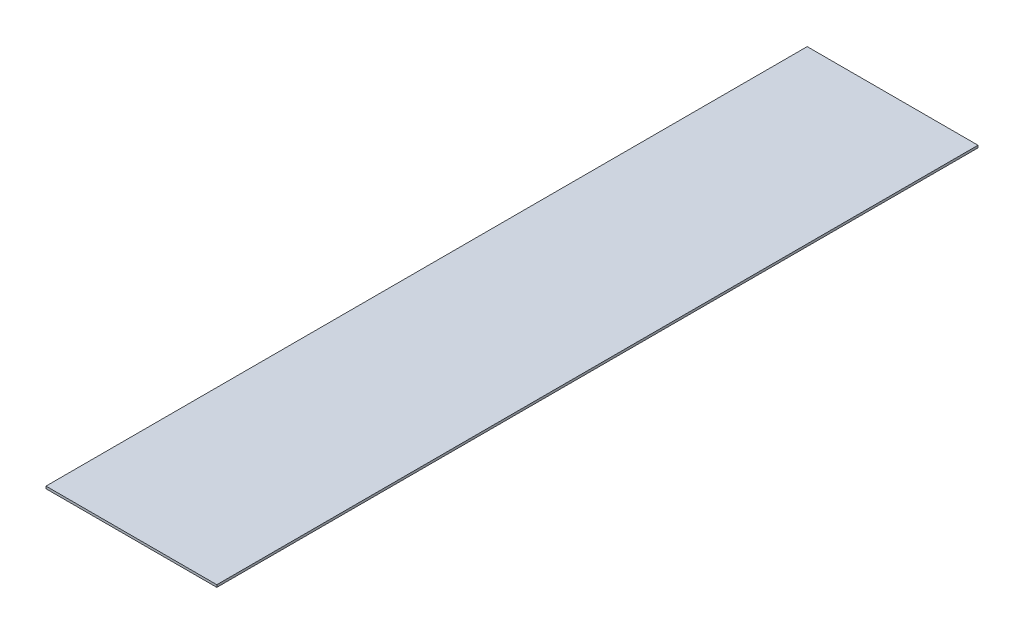
ISO-10303-21;
HEADER;
FILE_DESCRIPTION(('STEP AP214'),'2;1');
FILE_NAME('part.step','',(''),(''),'','','');
FILE_SCHEMA(('AUTOMOTIVE_DESIGN { 1 0 10303 214 1 1 1 1 }'));
ENDSEC;
DATA;
#1=APPLICATION_CONTEXT('core data for automotive mechanical design processes');
#2=APPLICATION_PROTOCOL_DEFINITION('international standard','automotive_design',2000,#1);
#3=PRODUCT_CONTEXT('',#1,'mechanical');
#4=PRODUCT('Part','Part','',(#3));
#5=PRODUCT_RELATED_PRODUCT_CATEGORY('part','',(#4));
#6=PRODUCT_DEFINITION_FORMATION('','',#4);
#7=PRODUCT_DEFINITION_CONTEXT('part definition',#1,'design');
#8=PRODUCT_DEFINITION('design','',#6,#7);
#9=PRODUCT_DEFINITION_SHAPE('','',#8);
#10=(LENGTH_UNIT() NAMED_UNIT(*) SI_UNIT(.MILLI.,.METRE.));
#11=(NAMED_UNIT(*) PLANE_ANGLE_UNIT() SI_UNIT($,.RADIAN.));
#12=(NAMED_UNIT(*) SI_UNIT($,.STERADIAN.) SOLID_ANGLE_UNIT());
#13=UNCERTAINTY_MEASURE_WITH_UNIT(LENGTH_MEASURE(1.E-05),#10,'distance_accuracy_value','');
#14=(GEOMETRIC_REPRESENTATION_CONTEXT(3) GLOBAL_UNCERTAINTY_ASSIGNED_CONTEXT((#13)) GLOBAL_UNIT_ASSIGNED_CONTEXT((#10,
#11,#12)) REPRESENTATION_CONTEXT('',''));
#15=CARTESIAN_POINT('',(0.,0.,0.));
#16=DIRECTION('',(0.,0.,1.));
#17=DIRECTION('',(1.,0.,0.));
#18=AXIS2_PLACEMENT_3D('',#15,#16,#17);
#19=CARTESIAN_POINT('',(-365.857303482587,2.54,-330.915875621891));
#20=DIRECTION('',(1.,0.,0.));
#21=DIRECTION('',(0.,0.,-1.));
#22=AXIS2_PLACEMENT_3D('',#19,#20,#21);
#23=PLANE('',#22);
#24=DIRECTION('',(0.,0.,1.));
#25=VECTOR('',#24,1.);
#26=CARTESIAN_POINT('',(-365.857303482587,0.,-330.915875621891));
#27=LINE('',#26,#25);
#28=CARTESIAN_POINT('',(-365.857303482587,0.,-330.915875621891));
#29=VERTEX_POINT('',#28);
#30=CARTESIAN_POINT('',(-365.857303482587,0.,495.346124378109));
#31=VERTEX_POINT('',#30);
#32=EDGE_CURVE('E107',#29,#31,#27,.T.);
#33=ORIENTED_EDGE('',*,*,#32,.T.);
#34=DIRECTION('',(0.,-1.,0.));
#35=VECTOR('',#34,1.);
#36=CARTESIAN_POINT('',(-365.857303482587,2.54,495.346124378109));
#37=LINE('',#36,#35);
#38=CARTESIAN_POINT('',(-365.857303482587,2.54,495.346124378109));
#39=VERTEX_POINT('',#38);
#40=EDGE_CURVE('E11',#39,#31,#37,.T.);
#41=ORIENTED_EDGE('',*,*,#40,.F.);
#42=DIRECTION('',(0.,0.,1.));
#43=VECTOR('',#42,1.);
#44=CARTESIAN_POINT('',(-365.857303482587,2.54,-330.915875621891));
#45=LINE('',#44,#43);
#46=CARTESIAN_POINT('',(-365.857303482587,2.54,-330.915875621891));
#47=VERTEX_POINT('',#46);
#48=EDGE_CURVE('E91',#47,#39,#45,.T.);
#49=ORIENTED_EDGE('',*,*,#48,.F.);
#50=DIRECTION('',(0.,-1.,0.));
#51=VECTOR('',#50,1.);
#52=CARTESIAN_POINT('',(-365.857303482587,2.54,-330.915875621891));
#53=LINE('',#52,#51);
#54=EDGE_CURVE('E103',#47,#29,#53,.T.);
#55=ORIENTED_EDGE('',*,*,#54,.T.);
#56=EDGE_LOOP('',(#33,#41,#49,#55));
#57=FACE_BOUND('',#56,.T.);
#58=ADVANCED_FACE('F39',(#57),#23,.F.);
#59=CARTESIAN_POINT('',(-365.857303482587,2.54,495.346124378109));
#60=DIRECTION('',(0.,0.,-1.));
#61=DIRECTION('',(-1.,0.,0.));
#62=AXIS2_PLACEMENT_3D('',#59,#60,#61);
#63=PLANE('',#62);
#64=DIRECTION('',(1.,0.,0.));
#65=VECTOR('',#64,1.);
#66=CARTESIAN_POINT('',(-365.857303482587,0.,495.346124378109));
#67=LINE('',#66,#65);
#68=CARTESIAN_POINT('',(-180.437303482587,0.,495.346124378109));
#69=VERTEX_POINT('',#68);
#70=EDGE_CURVE('E96',#31,#69,#67,.T.);
#71=ORIENTED_EDGE('',*,*,#70,.T.);
#72=DIRECTION('',(0.,-1.,0.));
#73=VECTOR('',#72,1.);
#74=CARTESIAN_POINT('',(-180.437303482587,2.54,495.346124378109));
#75=LINE('',#74,#73);
#76=CARTESIAN_POINT('',(-180.437303482587,2.54,495.346124378109));
#77=VERTEX_POINT('',#76);
#78=EDGE_CURVE('E48',#77,#69,#75,.T.);
#79=ORIENTED_EDGE('',*,*,#78,.F.);
#80=DIRECTION('',(1.,0.,0.));
#81=VECTOR('',#80,1.);
#82=CARTESIAN_POINT('',(-365.857303482587,2.54,495.346124378109));
#83=LINE('',#82,#81);
#84=EDGE_CURVE('E86',#39,#77,#83,.T.);
#85=ORIENTED_EDGE('',*,*,#84,.F.);
#86=ORIENTED_EDGE('',*,*,#40,.T.);
#87=EDGE_LOOP('',(#71,#79,#85,#86));
#88=FACE_BOUND('',#87,.T.);
#89=ADVANCED_FACE('F95',(#88),#63,.F.);
#90=CARTESIAN_POINT('',(-180.437303482587,2.54,-330.915875621891));
#91=DIRECTION('',(-1.,0.,0.));
#92=DIRECTION('',(0.,0.,1.));
#93=AXIS2_PLACEMENT_3D('',#90,#91,#92);
#94=PLANE('',#93);
#95=DIRECTION('',(0.,0.,-1.));
#96=VECTOR('',#95,1.);
#97=CARTESIAN_POINT('',(-180.437303482587,0.,-330.915875621891));
#98=LINE('',#97,#96);
#99=CARTESIAN_POINT('',(-180.437303482587,0.,-330.915875621891));
#100=VERTEX_POINT('',#99);
#101=EDGE_CURVE('E73',#69,#100,#98,.T.);
#102=ORIENTED_EDGE('',*,*,#101,.T.);
#103=DIRECTION('',(0.,-1.,0.));
#104=VECTOR('',#103,1.);
#105=CARTESIAN_POINT('',(-180.437303482587,2.54,-330.915875621891));
#106=LINE('',#105,#104);
#107=CARTESIAN_POINT('',(-180.437303482587,2.54,-330.915875621891));
#108=VERTEX_POINT('',#107);
#109=EDGE_CURVE('E98',#108,#100,#106,.T.);
#110=ORIENTED_EDGE('',*,*,#109,.F.);
#111=DIRECTION('',(0.,0.,-1.));
#112=VECTOR('',#111,1.);
#113=CARTESIAN_POINT('',(-180.437303482587,2.54,-330.915875621891));
#114=LINE('',#113,#112);
#115=EDGE_CURVE('E89',#77,#108,#114,.T.);
#116=ORIENTED_EDGE('',*,*,#115,.F.);
#117=ORIENTED_EDGE('',*,*,#78,.T.);
#118=EDGE_LOOP('',(#102,#110,#116,#117));
#119=FACE_BOUND('',#118,.T.);
#120=ADVANCED_FACE('F99',(#119),#94,.F.);
#121=CARTESIAN_POINT('',(-365.857303482587,2.54,-330.915875621891));
#122=DIRECTION('',(0.,0.,1.));
#123=DIRECTION('',(1.,0.,0.));
#124=AXIS2_PLACEMENT_3D('',#121,#122,#123);
#125=PLANE('',#124);
#126=DIRECTION('',(-1.,0.,0.));
#127=VECTOR('',#126,1.);
#128=CARTESIAN_POINT('',(-365.857303482587,0.,-330.915875621891));
#129=LINE('',#128,#127);
#130=EDGE_CURVE('E79',#100,#29,#129,.T.);
#131=ORIENTED_EDGE('',*,*,#130,.T.);
#132=ORIENTED_EDGE('',*,*,#54,.F.);
#133=DIRECTION('',(-1.,0.,0.));
#134=VECTOR('',#133,1.);
#135=CARTESIAN_POINT('',(-365.857303482587,2.54,-330.915875621891));
#136=LINE('',#135,#134);
#137=EDGE_CURVE('E56',#108,#47,#136,.T.);
#138=ORIENTED_EDGE('',*,*,#137,.F.);
#139=ORIENTED_EDGE('',*,*,#109,.T.);
#140=EDGE_LOOP('',(#131,#132,#138,#139));
#141=FACE_BOUND('',#140,.T.);
#142=ADVANCED_FACE('F120',(#141),#125,.F.);
#143=CARTESIAN_POINT('',(0.,2.54,0.));
#144=DIRECTION('',(0.,1.,0.));
#145=DIRECTION('',(0.,0.,1.));
#146=AXIS2_PLACEMENT_3D('',#143,#144,#145);
#147=PLANE('',#146);
#148=ORIENTED_EDGE('',*,*,#48,.T.);
#149=ORIENTED_EDGE('',*,*,#84,.T.);
#150=ORIENTED_EDGE('',*,*,#115,.T.);
#151=ORIENTED_EDGE('',*,*,#137,.T.);
#152=EDGE_LOOP('',(#148,#149,#150,#151));
#153=FACE_BOUND('',#152,.T.);
#154=ADVANCED_FACE('F87',(#153),#147,.T.);
#155=CARTESIAN_POINT('',(0.,0.,0.));
#156=DIRECTION('',(0.,1.,0.));
#157=DIRECTION('',(0.,0.,1.));
#158=AXIS2_PLACEMENT_3D('',#155,#156,#157);
#159=PLANE('',#158);
#160=ORIENTED_EDGE('',*,*,#32,.F.);
#161=ORIENTED_EDGE('',*,*,#130,.F.);
#162=ORIENTED_EDGE('',*,*,#101,.F.);
#163=ORIENTED_EDGE('',*,*,#70,.F.);
#164=EDGE_LOOP('',(#160,#161,#162,#163));
#165=FACE_BOUND('',#164,.T.);
#166=ADVANCED_FACE('F123',(#165),#159,.F.);
#167=CLOSED_SHELL('',(#58,#89,#120,#142,#154,#166));
#168=MANIFOLD_SOLID_BREP('B2',#167);
#169=ADVANCED_BREP_SHAPE_REPRESENTATION('',(#18,#168),#14);
#170=SHAPE_DEFINITION_REPRESENTATION(#9,#169);
ENDSEC;
END-ISO-10303-21;
